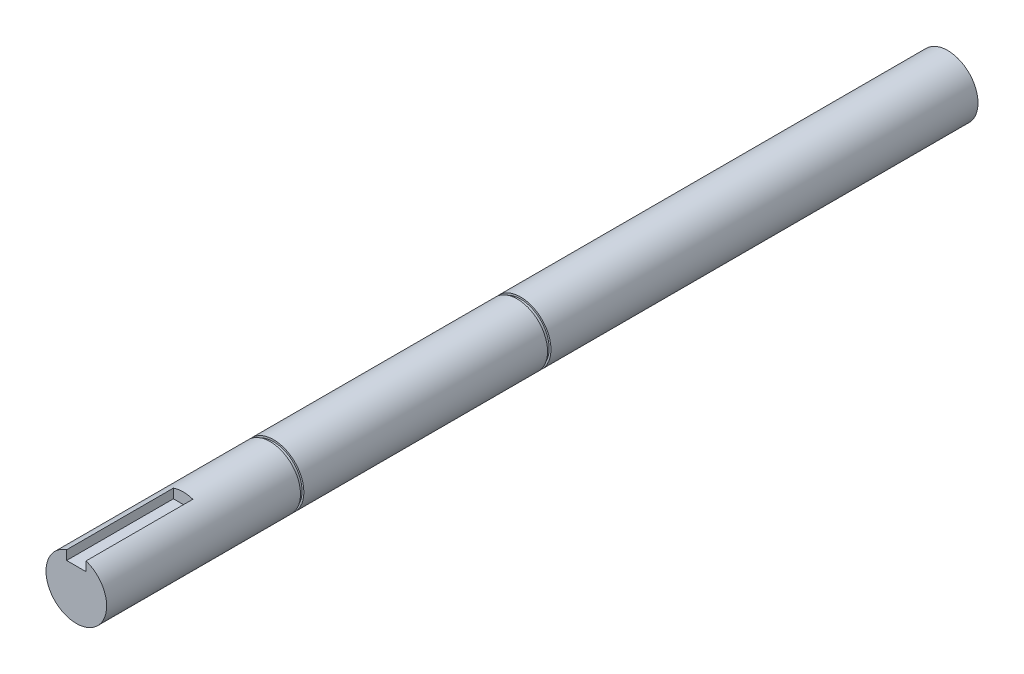
ISO-10303-21;
HEADER;
FILE_DESCRIPTION(('STEP AP214'),'2;1');
FILE_NAME('part.step','',(''),(''),'','','');
FILE_SCHEMA(('AUTOMOTIVE_DESIGN { 1 0 10303 214 1 1 1 1 }'));
ENDSEC;
DATA;
#1=APPLICATION_CONTEXT('core data for automotive mechanical design processes');
#2=APPLICATION_PROTOCOL_DEFINITION('international standard','automotive_design',2000,#1);
#3=PRODUCT_CONTEXT('',#1,'mechanical');
#4=PRODUCT('Part','Part','',(#3));
#5=PRODUCT_RELATED_PRODUCT_CATEGORY('part','',(#4));
#6=PRODUCT_DEFINITION_FORMATION('','',#4);
#7=PRODUCT_DEFINITION_CONTEXT('part definition',#1,'design');
#8=PRODUCT_DEFINITION('design','',#6,#7);
#9=PRODUCT_DEFINITION_SHAPE('','',#8);
#10=(LENGTH_UNIT() NAMED_UNIT(*) SI_UNIT(.MILLI.,.METRE.));
#11=(NAMED_UNIT(*) PLANE_ANGLE_UNIT() SI_UNIT($,.RADIAN.));
#12=(NAMED_UNIT(*) SI_UNIT($,.STERADIAN.) SOLID_ANGLE_UNIT());
#13=UNCERTAINTY_MEASURE_WITH_UNIT(LENGTH_MEASURE(1.E-05),#10,'distance_accuracy_value','');
#14=(GEOMETRIC_REPRESENTATION_CONTEXT(3) GLOBAL_UNCERTAINTY_ASSIGNED_CONTEXT((#13)) GLOBAL_UNIT_ASSIGNED_CONTEXT((#10,
#11,#12)) REPRESENTATION_CONTEXT('',''));
#15=CARTESIAN_POINT('',(0.,0.,0.));
#16=DIRECTION('',(0.,0.,1.));
#17=DIRECTION('',(1.,0.,0.));
#18=AXIS2_PLACEMENT_3D('',#15,#16,#17);
#19=CARTESIAN_POINT('',(0.,0.,-359.));
#20=DIRECTION('',(0.,0.,1.));
#21=DIRECTION('',(1.,0.,0.));
#22=AXIS2_PLACEMENT_3D('',#19,#20,#21);
#23=CYLINDRICAL_SURFACE('',#22,12.5);
#24=DIRECTION('',(0.,0.,1.));
#25=VECTOR('',#24,1.);
#26=CARTESIAN_POINT('',(4.,11.842719282327,-359.));
#27=LINE('',#26,#25);
#28=CARTESIAN_POINT('',(4.,11.842719282327,0.));
#29=VERTEX_POINT('',#28);
#30=CARTESIAN_POINT('',(4.,11.842719282327,-44.));
#31=VERTEX_POINT('',#30);
#32=EDGE_CURVE('E108',#29,#31,#27,.F.);
#33=ORIENTED_EDGE('',*,*,#32,.F.);
#34=CARTESIAN_POINT('',(0.,0.,0.));
#35=DIRECTION('',(0.,0.,1.));
#36=DIRECTION('',(1.,0.,0.));
#37=AXIS2_PLACEMENT_3D('',#34,#35,#36);
#38=CIRCLE('',#37,12.5);
#39=CARTESIAN_POINT('',(-4.,11.842719282327,0.));
#40=VERTEX_POINT('',#39);
#41=EDGE_CURVE('E110',#40,#29,#38,.T.);
#42=ORIENTED_EDGE('',*,*,#41,.F.);
#43=DIRECTION('',(0.,0.,1.));
#44=VECTOR('',#43,1.);
#45=CARTESIAN_POINT('',(-4.,11.842719282327,-359.));
#46=LINE('',#45,#44);
#47=CARTESIAN_POINT('',(-4.,11.842719282327,-44.));
#48=VERTEX_POINT('',#47);
#49=EDGE_CURVE('E51',#48,#40,#46,.T.);
#50=ORIENTED_EDGE('',*,*,#49,.F.);
#51=CARTESIAN_POINT('',(0.,0.,-44.));
#52=DIRECTION('',(0.,0.,1.));
#53=DIRECTION('',(1.,0.,0.));
#54=AXIS2_PLACEMENT_3D('',#51,#52,#53);
#55=CIRCLE('',#54,12.5);
#56=EDGE_CURVE('E11',#48,#31,#55,.F.);
#57=ORIENTED_EDGE('',*,*,#56,.T.);
#58=EDGE_LOOP('',(#33,#42,#50,#57));
#59=FACE_BOUND('',#58,.T.);
#60=CARTESIAN_POINT('',(0.,0.,-79.8499999999997));
#61=DIRECTION('',(0.,0.,-1.));
#62=DIRECTION('',(-1.,0.,0.));
#63=AXIS2_PLACEMENT_3D('',#60,#61,#62);
#64=CIRCLE('',#63,12.5);
#65=CARTESIAN_POINT('',(-12.5,0.,-79.8499999999997));
#66=VERTEX_POINT('',#65);
#67=EDGE_CURVE('E114',#66,#66,#64,.F.);
#68=ORIENTED_EDGE('',*,*,#67,.T.);
#69=EDGE_LOOP('',(#68));
#70=FACE_BOUND('',#69,.T.);
#71=ADVANCED_FACE('F34',(#59,#70),#23,.T.);
#72=CARTESIAN_POINT('',(0.,0.,0.));
#73=DIRECTION('',(0.,0.,1.));
#74=DIRECTION('',(1.,0.,0.));
#75=AXIS2_PLACEMENT_3D('',#72,#73,#74);
#76=PLANE('',#75);
#77=DIRECTION('',(0.,1.,0.));
#78=VECTOR('',#77,1.);
#79=CARTESIAN_POINT('',(4.,8.,0.));
#80=LINE('',#79,#78);
#81=CARTESIAN_POINT('',(4.,8.,0.));
#82=VERTEX_POINT('',#81);
#83=EDGE_CURVE('E59',#82,#29,#80,.T.);
#84=ORIENTED_EDGE('',*,*,#83,.F.);
#85=DIRECTION('',(1.,0.,0.));
#86=VECTOR('',#85,1.);
#87=CARTESIAN_POINT('',(-4.,8.,0.));
#88=LINE('',#87,#86);
#89=CARTESIAN_POINT('',(-4.,8.,0.));
#90=VERTEX_POINT('',#89);
#91=EDGE_CURVE('E90',#90,#82,#88,.T.);
#92=ORIENTED_EDGE('',*,*,#91,.F.);
#93=DIRECTION('',(0.,-1.,0.));
#94=VECTOR('',#93,1.);
#95=CARTESIAN_POINT('',(-3.99999999999999,0.,0.));
#96=LINE('',#95,#94);
#97=EDGE_CURVE('E43',#40,#90,#96,.T.);
#98=ORIENTED_EDGE('',*,*,#97,.F.);
#99=ORIENTED_EDGE('',*,*,#41,.T.);
#100=EDGE_LOOP('',(#84,#92,#98,#99));
#101=FACE_BOUND('',#100,.T.);
#102=ADVANCED_FACE('F95',(#101),#76,.T.);
#103=CARTESIAN_POINT('',(4.,8.,-55.6726175299288));
#104=DIRECTION('',(1.,0.,0.));
#105=DIRECTION('',(0.,0.,-1.));
#106=AXIS2_PLACEMENT_3D('',#103,#104,#105);
#107=PLANE('',#106);
#108=ORIENTED_EDGE('',*,*,#32,.T.);
#109=DIRECTION('',(0.,-1.,0.));
#110=VECTOR('',#109,1.);
#111=CARTESIAN_POINT('',(4.,8.,-44.));
#112=LINE('',#111,#110);
#113=CARTESIAN_POINT('',(4.,8.,-44.));
#114=VERTEX_POINT('',#113);
#115=EDGE_CURVE('E101',#31,#114,#112,.T.);
#116=ORIENTED_EDGE('',*,*,#115,.T.);
#117=DIRECTION('',(0.,0.,1.));
#118=VECTOR('',#117,1.);
#119=CARTESIAN_POINT('',(4.,8.,-55.6726175299288));
#120=LINE('',#119,#118);
#121=EDGE_CURVE('E93',#114,#82,#120,.T.);
#122=ORIENTED_EDGE('',*,*,#121,.T.);
#123=ORIENTED_EDGE('',*,*,#83,.T.);
#124=EDGE_LOOP('',(#108,#116,#122,#123));
#125=FACE_BOUND('',#124,.T.);
#126=ADVANCED_FACE('F145',(#125),#107,.F.);
#127=CARTESIAN_POINT('',(-4.,8.,-55.6726175299288));
#128=DIRECTION('',(0.,-1.,0.));
#129=DIRECTION('',(0.,0.,-1.));
#130=AXIS2_PLACEMENT_3D('',#127,#128,#129);
#131=PLANE('',#130);
#132=DIRECTION('',(-1.,0.,0.));
#133=VECTOR('',#132,1.);
#134=CARTESIAN_POINT('',(-4.,8.,-44.));
#135=LINE('',#134,#133);
#136=CARTESIAN_POINT('',(-4.,8.,-44.));
#137=VERTEX_POINT('',#136);
#138=EDGE_CURVE('E92',#114,#137,#135,.T.);
#139=ORIENTED_EDGE('',*,*,#138,.T.);
#140=DIRECTION('',(0.,0.,1.));
#141=VECTOR('',#140,1.);
#142=CARTESIAN_POINT('',(-4.,8.,-55.6726175299288));
#143=LINE('',#142,#141);
#144=EDGE_CURVE('E78',#137,#90,#143,.T.);
#145=ORIENTED_EDGE('',*,*,#144,.T.);
#146=ORIENTED_EDGE('',*,*,#91,.T.);
#147=ORIENTED_EDGE('',*,*,#121,.F.);
#148=EDGE_LOOP('',(#139,#145,#146,#147));
#149=FACE_BOUND('',#148,.T.);
#150=ADVANCED_FACE('F88',(#149),#131,.F.);
#151=CARTESIAN_POINT('',(-4.,16.5,-55.6726175299288));
#152=DIRECTION('',(-1.,0.,0.));
#153=DIRECTION('',(0.,-1.,0.));
#154=AXIS2_PLACEMENT_3D('',#151,#152,#153);
#155=PLANE('',#154);
#156=ORIENTED_EDGE('',*,*,#49,.T.);
#157=ORIENTED_EDGE('',*,*,#97,.T.);
#158=ORIENTED_EDGE('',*,*,#144,.F.);
#159=DIRECTION('',(0.,1.,0.));
#160=VECTOR('',#159,1.);
#161=CARTESIAN_POINT('',(-4.,16.5,-44.));
#162=LINE('',#161,#160);
#163=EDGE_CURVE('E105',#137,#48,#162,.T.);
#164=ORIENTED_EDGE('',*,*,#163,.T.);
#165=EDGE_LOOP('',(#156,#157,#158,#164));
#166=FACE_BOUND('',#165,.T.);
#167=ADVANCED_FACE('F77',(#166),#155,.F.);
#168=CARTESIAN_POINT('',(0.,0.,-44.));
#169=DIRECTION('',(0.,0.,1.));
#170=DIRECTION('',(1.,0.,0.));
#171=AXIS2_PLACEMENT_3D('',#168,#169,#170);
#172=PLANE('',#171);
#173=ORIENTED_EDGE('',*,*,#163,.F.);
#174=ORIENTED_EDGE('',*,*,#138,.F.);
#175=ORIENTED_EDGE('',*,*,#115,.F.);
#176=ORIENTED_EDGE('',*,*,#56,.F.);
#177=EDGE_LOOP('',(#173,#174,#175,#176));
#178=FACE_BOUND('',#177,.T.);
#179=ADVANCED_FACE('F147',(#178),#172,.T.);
#180=CARTESIAN_POINT('',(0.,14.012849938622,-81.2499999999997));
#181=DIRECTION('',(0.,0.,1.));
#182=DIRECTION('',(1.,0.,0.));
#183=AXIS2_PLACEMENT_3D('',#180,#181,#182);
#184=PLANE('',#183);
#185=CARTESIAN_POINT('',(0.,0.,-81.2499999999997));
#186=DIRECTION('',(0.,0.,1.));
#187=DIRECTION('',(1.,0.,0.));
#188=AXIS2_PLACEMENT_3D('',#185,#186,#187);
#189=CIRCLE('',#188,12.5);
#190=CARTESIAN_POINT('',(12.5,0.,-81.2499999999997));
#191=VERTEX_POINT('',#190);
#192=EDGE_CURVE('E117',#191,#191,#189,.F.);
#193=ORIENTED_EDGE('',*,*,#192,.F.);
#194=EDGE_LOOP('',(#193));
#195=FACE_BOUND('',#194,.T.);
#196=CARTESIAN_POINT('',(0.,0.,-81.2499999999998));
#197=DIRECTION('',(0.,0.,1.));
#198=DIRECTION('',(1.,0.,0.));
#199=AXIS2_PLACEMENT_3D('',#196,#197,#198);
#200=CIRCLE('',#199,11.75);
#201=CARTESIAN_POINT('',(11.75,0.,-81.2499999999998));
#202=VERTEX_POINT('',#201);
#203=EDGE_CURVE('E135',#202,#202,#200,.T.);
#204=ORIENTED_EDGE('',*,*,#203,.F.);
#205=EDGE_LOOP('',(#204));
#206=FACE_BOUND('',#205,.T.);
#207=ADVANCED_FACE('F161',(#195,#206),#184,.T.);
#208=CARTESIAN_POINT('',(0.,0.,1000.));
#209=DIRECTION('',(0.,0.,1.));
#210=DIRECTION('',(1.,0.,0.));
#211=AXIS2_PLACEMENT_3D('',#208,#209,#210);
#212=CYLINDRICAL_SURFACE('',#211,11.75);
#213=ORIENTED_EDGE('',*,*,#203,.T.);
#214=EDGE_LOOP('',(#213));
#215=FACE_BOUND('',#214,.T.);
#216=CARTESIAN_POINT('',(0.,0.,-79.8499999999998));
#217=DIRECTION('',(0.,0.,1.));
#218=DIRECTION('',(1.,0.,0.));
#219=AXIS2_PLACEMENT_3D('',#216,#217,#218);
#220=CIRCLE('',#219,11.75);
#221=CARTESIAN_POINT('',(11.75,0.,-79.8499999999998));
#222=VERTEX_POINT('',#221);
#223=EDGE_CURVE('E140',#222,#222,#220,.T.);
#224=ORIENTED_EDGE('',*,*,#223,.F.);
#225=EDGE_LOOP('',(#224));
#226=FACE_BOUND('',#225,.T.);
#227=ADVANCED_FACE('F156',(#215,#226),#212,.T.);
#228=CARTESIAN_POINT('',(0.,14.012849938622,-79.8499999999997));
#229=DIRECTION('',(0.,0.,-1.));
#230=DIRECTION('',(-1.,0.,0.));
#231=AXIS2_PLACEMENT_3D('',#228,#229,#230);
#232=PLANE('',#231);
#233=ORIENTED_EDGE('',*,*,#67,.F.);
#234=EDGE_LOOP('',(#233));
#235=FACE_BOUND('',#234,.T.);
#236=ORIENTED_EDGE('',*,*,#223,.T.);
#237=EDGE_LOOP('',(#236));
#238=FACE_BOUND('',#237,.T.);
#239=ADVANCED_FACE('F153',(#235,#238),#232,.T.);
#240=ORIENTED_EDGE('',*,*,#192,.T.);
#241=EDGE_LOOP('',(#240));
#242=FACE_BOUND('',#241,.T.);
#243=CARTESIAN_POINT('',(0.,0.,-181.65));
#244=DIRECTION('',(0.,0.,-1.));
#245=DIRECTION('',(-1.,0.,0.));
#246=AXIS2_PLACEMENT_3D('',#243,#244,#245);
#247=CIRCLE('',#246,12.5);
#248=CARTESIAN_POINT('',(-12.5,0.,-181.65));
#249=VERTEX_POINT('',#248);
#250=EDGE_CURVE('E38',#249,#249,#247,.F.);
#251=ORIENTED_EDGE('',*,*,#250,.T.);
#252=EDGE_LOOP('',(#251));
#253=FACE_BOUND('',#252,.T.);
#254=ADVANCED_FACE('F36',(#242,#253),#23,.T.);
#255=CARTESIAN_POINT('',(0.,14.1458849761481,-181.65));
#256=DIRECTION('',(0.,0.,-1.));
#257=DIRECTION('',(-1.,0.,0.));
#258=AXIS2_PLACEMENT_3D('',#255,#256,#257);
#259=PLANE('',#258);
#260=ORIENTED_EDGE('',*,*,#250,.F.);
#261=EDGE_LOOP('',(#260));
#262=FACE_BOUND('',#261,.T.);
#263=CARTESIAN_POINT('',(0.,0.,-181.65));
#264=DIRECTION('',(0.,0.,1.));
#265=DIRECTION('',(1.,0.,0.));
#266=AXIS2_PLACEMENT_3D('',#263,#264,#265);
#267=CIRCLE('',#266,11.75);
#268=CARTESIAN_POINT('',(11.75,0.,-181.65));
#269=VERTEX_POINT('',#268);
#270=EDGE_CURVE('E118',#269,#269,#267,.T.);
#271=ORIENTED_EDGE('',*,*,#270,.T.);
#272=EDGE_LOOP('',(#271));
#273=FACE_BOUND('',#272,.T.);
#274=ADVANCED_FACE('F229',(#262,#273),#259,.T.);
#275=CARTESIAN_POINT('',(0.,0.,1000.));
#276=DIRECTION('',(0.,0.,1.));
#277=DIRECTION('',(1.,0.,0.));
#278=AXIS2_PLACEMENT_3D('',#275,#276,#277);
#279=CYLINDRICAL_SURFACE('',#278,11.75);
#280=CARTESIAN_POINT('',(0.,0.,-183.05));
#281=DIRECTION('',(0.,0.,1.));
#282=DIRECTION('',(1.,0.,0.));
#283=AXIS2_PLACEMENT_3D('',#280,#281,#282);
#284=CIRCLE('',#283,11.75);
#285=CARTESIAN_POINT('',(11.75,0.,-183.05));
#286=VERTEX_POINT('',#285);
#287=EDGE_CURVE('E133',#286,#286,#284,.T.);
#288=ORIENTED_EDGE('',*,*,#287,.T.);
#289=EDGE_LOOP('',(#288));
#290=FACE_BOUND('',#289,.T.);
#291=ORIENTED_EDGE('',*,*,#270,.F.);
#292=EDGE_LOOP('',(#291));
#293=FACE_BOUND('',#292,.T.);
#294=ADVANCED_FACE('F129',(#290,#293),#279,.T.);
#295=CARTESIAN_POINT('',(0.,14.1458849761481,-183.05));
#296=DIRECTION('',(0.,0.,1.));
#297=DIRECTION('',(1.,0.,0.));
#298=AXIS2_PLACEMENT_3D('',#295,#296,#297);
#299=PLANE('',#298);
#300=CARTESIAN_POINT('',(0.,0.,-183.05));
#301=DIRECTION('',(0.,0.,1.));
#302=DIRECTION('',(1.,0.,0.));
#303=AXIS2_PLACEMENT_3D('',#300,#301,#302);
#304=CIRCLE('',#303,12.5);
#305=CARTESIAN_POINT('',(12.5,0.,-183.05));
#306=VERTEX_POINT('',#305);
#307=EDGE_CURVE('E99',#306,#306,#304,.F.);
#308=ORIENTED_EDGE('',*,*,#307,.F.);
#309=EDGE_LOOP('',(#308));
#310=FACE_BOUND('',#309,.T.);
#311=ORIENTED_EDGE('',*,*,#287,.F.);
#312=EDGE_LOOP('',(#311));
#313=FACE_BOUND('',#312,.T.);
#314=ADVANCED_FACE('F125',(#310,#313),#299,.T.);
#315=CARTESIAN_POINT('',(0.,0.,-359.));
#316=DIRECTION('',(0.,0.,1.));
#317=DIRECTION('',(1.,0.,0.));
#318=AXIS2_PLACEMENT_3D('',#315,#316,#317);
#319=PLANE('',#318);
#320=CARTESIAN_POINT('',(0.,0.,-359.));
#321=DIRECTION('',(0.,0.,1.));
#322=DIRECTION('',(1.,0.,0.));
#323=AXIS2_PLACEMENT_3D('',#320,#321,#322);
#324=CIRCLE('',#323,12.5);
#325=CARTESIAN_POINT('',(12.5,0.,-359.));
#326=VERTEX_POINT('',#325);
#327=EDGE_CURVE('E84',#326,#326,#324,.T.);
#328=ORIENTED_EDGE('',*,*,#327,.F.);
#329=EDGE_LOOP('',(#328));
#330=FACE_BOUND('',#329,.T.);
#331=ADVANCED_FACE('F128',(#330),#319,.F.);
#332=ORIENTED_EDGE('',*,*,#327,.T.);
#333=EDGE_LOOP('',(#332));
#334=FACE_BOUND('',#333,.T.);
#335=ORIENTED_EDGE('',*,*,#307,.T.);
#336=EDGE_LOOP('',(#335));
#337=FACE_BOUND('',#336,.T.);
#338=ADVANCED_FACE('F123',(#334,#337),#23,.T.);
#339=CLOSED_SHELL('',(#71,#102,#126,#150,#167,#179,#207,#227,#239,#254,#274,#294,#314,#331,#338));
#340=MANIFOLD_SOLID_BREP('B2',#339);
#341=ADVANCED_BREP_SHAPE_REPRESENTATION('',(#18,#340),#14);
#342=SHAPE_DEFINITION_REPRESENTATION(#9,#341);
ENDSEC;
END-ISO-10303-21;
